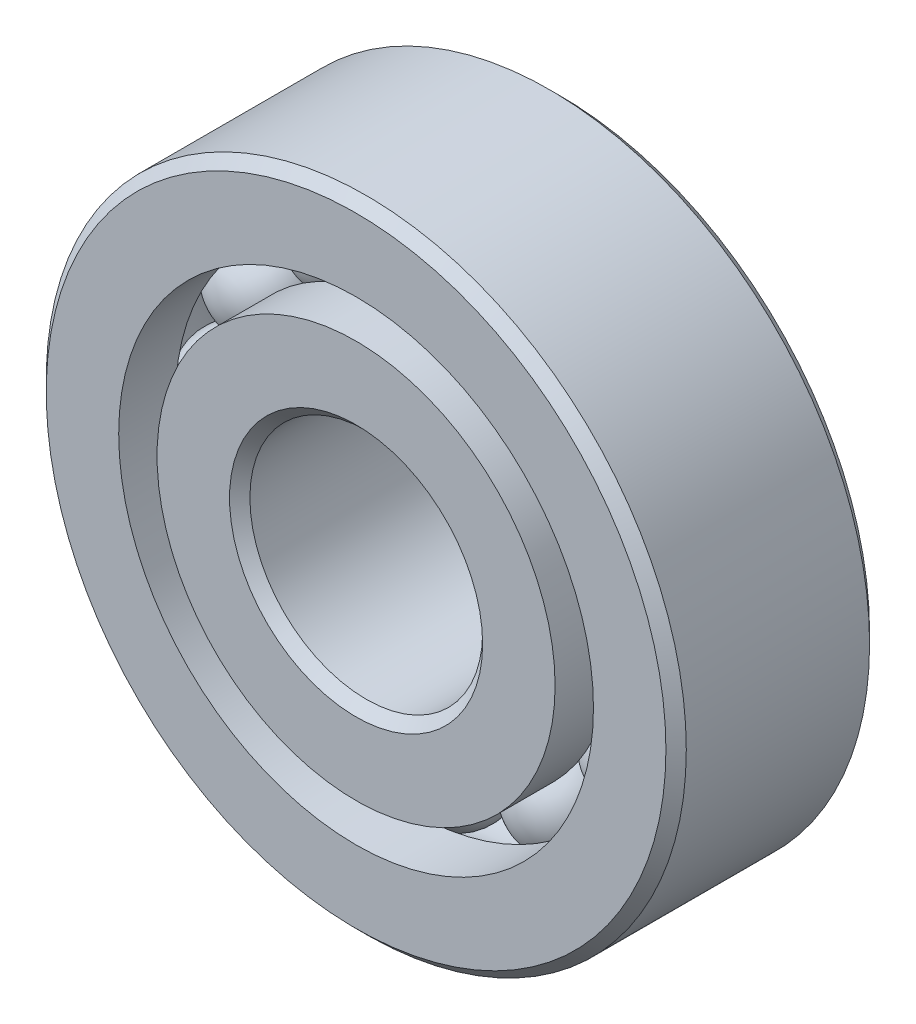
ISO-10303-21;
HEADER;
FILE_DESCRIPTION(('STEP AP214'),'2;1');
FILE_NAME('part.step','',(''),(''),'','','');
FILE_SCHEMA(('AUTOMOTIVE_DESIGN { 1 0 10303 214 1 1 1 1 }'));
ENDSEC;
DATA;
#1=APPLICATION_CONTEXT('core data for automotive mechanical design processes');
#2=APPLICATION_PROTOCOL_DEFINITION('international standard','automotive_design',2000,#1);
#3=PRODUCT_CONTEXT('',#1,'mechanical');
#4=PRODUCT('Part','Part','',(#3));
#5=PRODUCT_RELATED_PRODUCT_CATEGORY('part','',(#4));
#6=PRODUCT_DEFINITION_FORMATION('','',#4);
#7=PRODUCT_DEFINITION_CONTEXT('part definition',#1,'design');
#8=PRODUCT_DEFINITION('design','',#6,#7);
#9=PRODUCT_DEFINITION_SHAPE('','',#8);
#10=(LENGTH_UNIT() NAMED_UNIT(*) SI_UNIT(.MILLI.,.METRE.));
#11=(NAMED_UNIT(*) PLANE_ANGLE_UNIT() SI_UNIT($,.RADIAN.));
#12=(NAMED_UNIT(*) SI_UNIT($,.STERADIAN.) SOLID_ANGLE_UNIT());
#13=UNCERTAINTY_MEASURE_WITH_UNIT(LENGTH_MEASURE(1.E-05),#10,'distance_accuracy_value','');
#14=(GEOMETRIC_REPRESENTATION_CONTEXT(3) GLOBAL_UNCERTAINTY_ASSIGNED_CONTEXT((#13)) GLOBAL_UNIT_ASSIGNED_CONTEXT((#10,
#11,#12)) REPRESENTATION_CONTEXT('',''));
#15=CARTESIAN_POINT('',(0.,0.,0.));
#16=DIRECTION('',(0.,0.,1.));
#17=DIRECTION('',(1.,0.,0.));
#18=AXIS2_PLACEMENT_3D('',#15,#16,#17);
#19=CARTESIAN_POINT('',(-3.74999999999992,6.49519052838334,0.));
#20=DIRECTION('',(0.,0.,1.));
#21=DIRECTION('',(-0.499999999999989,0.866025403784445,0.));
#22=AXIS2_PLACEMENT_3D('',#19,#20,#21);
#23=SPHERICAL_SURFACE('',#22,1.68952158656808);
#24=CARTESIAN_POINT('',(-3.74999999999992,6.49519052838334,1.68952158656808));
#25=VERTEX_POINT('',#24);
#26=VERTEX_LOOP('',#25);
#27=FACE_BOUND('',#26,.T.);
#28=ADVANCED_FACE('F43',(#27),#23,.T.);
#29=CLOSED_SHELL('',(#28));
#30=MANIFOLD_SOLID_BREP('B2',#29);
#31=CARTESIAN_POINT('',(-6.49519052838325,3.75000000000008,0.));
#32=DIRECTION('',(0.,0.,1.));
#33=DIRECTION('',(-0.866025403784433,0.50000000000001,0.));
#34=AXIS2_PLACEMENT_3D('',#31,#32,#33);
#35=SPHERICAL_SURFACE('',#34,1.68952158656808);
#36=CARTESIAN_POINT('',(-6.49519052838325,3.75000000000008,1.68952158656808));
#37=VERTEX_POINT('',#36);
#38=VERTEX_LOOP('',#37);
#39=FACE_BOUND('',#38,.T.);
#40=ADVANCED_FACE('F64',(#39),#35,.T.);
#41=CLOSED_SHELL('',(#40));
#42=MANIFOLD_SOLID_BREP('B6',#41);
#43=CARTESIAN_POINT('',(-7.5,0.,0.));
#44=DIRECTION('',(0.,0.,1.));
#45=DIRECTION('',(-1.,0.,0.));
#46=AXIS2_PLACEMENT_3D('',#43,#44,#45);
#47=SPHERICAL_SURFACE('',#46,1.68952158656808);
#48=CARTESIAN_POINT('',(-7.5,0.,1.68952158656808));
#49=VERTEX_POINT('',#48);
#50=VERTEX_LOOP('',#49);
#51=FACE_BOUND('',#50,.T.);
#52=ADVANCED_FACE('F88',(#51),#47,.T.);
#53=CLOSED_SHELL('',(#52));
#54=MANIFOLD_SOLID_BREP('B39',#53);
#55=CARTESIAN_POINT('',(-6.49519052838332,-3.74999999999994,0.));
#56=DIRECTION('',(0.,0.,1.));
#57=DIRECTION('',(-0.866025403784443,-0.499999999999992,0.));
#58=AXIS2_PLACEMENT_3D('',#55,#56,#57);
#59=SPHERICAL_SURFACE('',#58,1.68952158656808);
#60=CARTESIAN_POINT('',(-6.49519052838332,-3.74999999999994,1.68952158656808));
#61=VERTEX_POINT('',#60);
#62=VERTEX_LOOP('',#61);
#63=FACE_BOUND('',#62,.T.);
#64=ADVANCED_FACE('F111',(#63),#59,.T.);
#65=CLOSED_SHELL('',(#64));
#66=MANIFOLD_SOLID_BREP('B60',#65);
#67=CARTESIAN_POINT('',(-3.75000000000005,-6.49519052838326,0.));
#68=DIRECTION('',(0.,0.,1.));
#69=DIRECTION('',(-0.500000000000007,-0.866025403784435,0.));
#70=AXIS2_PLACEMENT_3D('',#67,#68,#69);
#71=SPHERICAL_SURFACE('',#70,1.68952158656808);
#72=CARTESIAN_POINT('',(-3.75000000000005,-6.49519052838326,1.68952158656808));
#73=VERTEX_POINT('',#72);
#74=VERTEX_LOOP('',#73);
#75=FACE_BOUND('',#74,.T.);
#76=ADVANCED_FACE('F131',(#75),#71,.T.);
#77=CLOSED_SHELL('',(#76));
#78=MANIFOLD_SOLID_BREP('B84',#77);
#79=CARTESIAN_POINT('',(0.,-7.5,0.));
#80=DIRECTION('',(0.,0.,1.));
#81=DIRECTION('',(0.,-1.,0.));
#82=AXIS2_PLACEMENT_3D('',#79,#80,#81);
#83=SPHERICAL_SURFACE('',#82,1.68952158656808);
#84=CARTESIAN_POINT('',(0.,-7.5,1.68952158656808));
#85=VERTEX_POINT('',#84);
#86=VERTEX_LOOP('',#85);
#87=FACE_BOUND('',#86,.T.);
#88=ADVANCED_FACE('F151',(#87),#83,.T.);
#89=CLOSED_SHELL('',(#88));
#90=MANIFOLD_SOLID_BREP('B107',#89);
#91=CARTESIAN_POINT('',(3.74999999999996,-6.49519052838331,0.));
#92=DIRECTION('',(0.,0.,1.));
#93=DIRECTION('',(0.499999999999995,-0.866025403784442,0.));
#94=AXIS2_PLACEMENT_3D('',#91,#92,#93);
#95=SPHERICAL_SURFACE('',#94,1.68952158656808);
#96=CARTESIAN_POINT('',(3.74999999999996,-6.49519052838331,1.68952158656808));
#97=VERTEX_POINT('',#96);
#98=VERTEX_LOOP('',#97);
#99=FACE_BOUND('',#98,.T.);
#100=ADVANCED_FACE('F172',(#99),#95,.T.);
#101=CLOSED_SHELL('',(#100));
#102=MANIFOLD_SOLID_BREP('B127',#101);
#103=CARTESIAN_POINT('',(6.49519052838327,-3.75000000000003,0.));
#104=DIRECTION('',(0.,0.,1.));
#105=DIRECTION('',(0.866025403784436,-0.500000000000004,0.));
#106=AXIS2_PLACEMENT_3D('',#103,#104,#105);
#107=SPHERICAL_SURFACE('',#106,1.68952158656808);
#108=CARTESIAN_POINT('',(6.49519052838327,-3.75000000000003,1.68952158656808));
#109=VERTEX_POINT('',#108);
#110=VERTEX_LOOP('',#109);
#111=FACE_BOUND('',#110,.T.);
#112=ADVANCED_FACE('F196',(#111),#107,.T.);
#113=CLOSED_SHELL('',(#112));
#114=MANIFOLD_SOLID_BREP('B147',#113);
#115=CARTESIAN_POINT('',(7.5,0.,0.));
#116=DIRECTION('',(0.,0.,1.));
#117=DIRECTION('',(1.,0.,0.));
#118=AXIS2_PLACEMENT_3D('',#115,#116,#117);
#119=SPHERICAL_SURFACE('',#118,1.68952158656808);
#120=CARTESIAN_POINT('',(7.5,0.,1.68952158656808));
#121=VERTEX_POINT('',#120);
#122=VERTEX_LOOP('',#121);
#123=FACE_BOUND('',#122,.T.);
#124=ADVANCED_FACE('F220',(#123),#119,.T.);
#125=CLOSED_SHELL('',(#124));
#126=MANIFOLD_SOLID_BREP('B168',#125);
#127=CARTESIAN_POINT('',(6.4951905283833,3.74999999999998,0.));
#128=DIRECTION('',(0.,0.,1.));
#129=DIRECTION('',(0.86602540378444,0.499999999999998,0.));
#130=AXIS2_PLACEMENT_3D('',#127,#128,#129);
#131=SPHERICAL_SURFACE('',#130,1.68952158656808);
#132=CARTESIAN_POINT('',(6.4951905283833,3.74999999999998,1.68952158656808));
#133=VERTEX_POINT('',#132);
#134=VERTEX_LOOP('',#133);
#135=FACE_BOUND('',#134,.T.);
#136=ADVANCED_FACE('F244',(#135),#131,.T.);
#137=CLOSED_SHELL('',(#136));
#138=MANIFOLD_SOLID_BREP('B192',#137);
#139=CARTESIAN_POINT('',(3.75000000000001,6.49519052838328,0.));
#140=DIRECTION('',(0.,0.,1.));
#141=DIRECTION('',(0.500000000000001,0.866025403784438,0.));
#142=AXIS2_PLACEMENT_3D('',#139,#140,#141);
#143=SPHERICAL_SURFACE('',#142,1.68952158656808);
#144=CARTESIAN_POINT('',(3.75000000000001,6.49519052838328,1.68952158656808));
#145=VERTEX_POINT('',#144);
#146=VERTEX_LOOP('',#145);
#147=FACE_BOUND('',#146,.T.);
#148=ADVANCED_FACE('F268',(#147),#143,.T.);
#149=CLOSED_SHELL('',(#148));
#150=MANIFOLD_SOLID_BREP('B216',#149);
#151=CARTESIAN_POINT('',(0.,7.5,0.));
#152=DIRECTION('',(0.,0.,1.));
#153=DIRECTION('',(0.,1.,0.));
#154=AXIS2_PLACEMENT_3D('',#151,#152,#153);
#155=SPHERICAL_SURFACE('',#154,1.68952158656808);
#156=CARTESIAN_POINT('',(0.,7.5,1.68952158656808));
#157=VERTEX_POINT('',#156);
#158=VERTEX_LOOP('',#157);
#159=FACE_BOUND('',#158,.T.);
#160=ADVANCED_FACE('F294',(#159),#155,.T.);
#161=CLOSED_SHELL('',(#160));
#162=MANIFOLD_SOLID_BREP('B240',#161);
#163=CARTESIAN_POINT('',(0.,6.84065934065934,3.5));
#164=DIRECTION('',(0.,0.,-1.));
#165=DIRECTION('',(-1.,0.,0.));
#166=AXIS2_PLACEMENT_3D('',#163,#164,#165);
#167=PLANE('',#166);
#168=CARTESIAN_POINT('',(0.,0.,3.5));
#169=DIRECTION('',(0.,0.,1.));
#170=DIRECTION('',(1.,0.,0.));
#171=AXIS2_PLACEMENT_3D('',#168,#169,#170);
#172=CIRCLE('',#171,4.35);
#173=CARTESIAN_POINT('',(4.35,0.,3.5));
#174=VERTEX_POINT('',#173);
#175=EDGE_CURVE('E345',#174,#174,#172,.T.);
#176=ORIENTED_EDGE('',*,*,#175,.F.);
#177=EDGE_LOOP('',(#176));
#178=FACE_BOUND('',#177,.T.);
#179=CARTESIAN_POINT('',(0.,0.,3.5));
#180=DIRECTION('',(0.,0.,1.));
#181=DIRECTION('',(1.,0.,0.));
#182=AXIS2_PLACEMENT_3D('',#179,#180,#181);
#183=CIRCLE('',#182,6.84065934065934);
#184=CARTESIAN_POINT('',(6.84065934065934,0.,3.5));
#185=VERTEX_POINT('',#184);
#186=EDGE_CURVE('E293',#185,#185,#183,.T.);
#187=ORIENTED_EDGE('',*,*,#186,.T.);
#188=EDGE_LOOP('',(#187));
#189=FACE_BOUND('',#188,.T.);
#190=ADVANCED_FACE('F317',(#178,#189),#167,.F.);
#191=CARTESIAN_POINT('',(0.,0.,3.5));
#192=DIRECTION('',(0.,0.,1.));
#193=DIRECTION('',(1.,0.,0.));
#194=AXIS2_PLACEMENT_3D('',#191,#192,#193);
#195=CYLINDRICAL_SURFACE('',#194,6.84065934065934);
#196=ORIENTED_EDGE('',*,*,#186,.F.);
#197=EDGE_LOOP('',(#196));
#198=FACE_BOUND('',#197,.T.);
#199=CARTESIAN_POINT('',(0.,0.,1.55555555555556));
#200=DIRECTION('',(0.,0.,1.));
#201=DIRECTION('',(1.,0.,0.));
#202=AXIS2_PLACEMENT_3D('',#199,#200,#201);
#203=CIRCLE('',#202,6.84065934065934);
#204=CARTESIAN_POINT('',(6.84065934065934,0.,1.55555555555556));
#205=VERTEX_POINT('',#204);
#206=EDGE_CURVE('E323',#205,#205,#203,.T.);
#207=ORIENTED_EDGE('',*,*,#206,.T.);
#208=EDGE_LOOP('',(#207));
#209=FACE_BOUND('',#208,.T.);
#210=ADVANCED_FACE('F352',(#198,#209),#195,.T.);
#211=CARTESIAN_POINT('',(0.,0.,0.));
#212=DIRECTION('',(0.,0.,1.));
#213=DIRECTION('',(1.,0.,0.));
#214=AXIS2_PLACEMENT_3D('',#211,#212,#213);
#215=TOROIDAL_SURFACE('',#214,7.5,1.68952158656808);
#216=ORIENTED_EDGE('',*,*,#206,.F.);
#217=EDGE_LOOP('',(#216));
#218=FACE_BOUND('',#217,.T.);
#219=CARTESIAN_POINT('',(0.,0.,-1.55555555555556));
#220=DIRECTION('',(0.,0.,1.));
#221=DIRECTION('',(1.,0.,0.));
#222=AXIS2_PLACEMENT_3D('',#219,#220,#221);
#223=CIRCLE('',#222,6.84065934065934);
#224=CARTESIAN_POINT('',(6.84065934065934,0.,-1.55555555555556));
#225=VERTEX_POINT('',#224);
#226=EDGE_CURVE('E327',#225,#225,#223,.T.);
#227=ORIENTED_EDGE('',*,*,#226,.T.);
#228=EDGE_LOOP('',(#227));
#229=FACE_BOUND('',#228,.T.);
#230=ADVANCED_FACE('F356',(#218,#229),#215,.F.);
#231=CARTESIAN_POINT('',(0.,0.,3.5));
#232=DIRECTION('',(0.,0.,1.));
#233=DIRECTION('',(1.,0.,0.));
#234=AXIS2_PLACEMENT_3D('',#231,#232,#233);
#235=CYLINDRICAL_SURFACE('',#234,6.84065934065934);
#236=ORIENTED_EDGE('',*,*,#226,.F.);
#237=EDGE_LOOP('',(#236));
#238=FACE_BOUND('',#237,.T.);
#239=CARTESIAN_POINT('',(0.,0.,-3.5));
#240=DIRECTION('',(0.,0.,1.));
#241=DIRECTION('',(1.,0.,0.));
#242=AXIS2_PLACEMENT_3D('',#239,#240,#241);
#243=CIRCLE('',#242,6.84065934065934);
#244=CARTESIAN_POINT('',(6.84065934065934,0.,-3.5));
#245=VERTEX_POINT('',#244);
#246=EDGE_CURVE('E331',#245,#245,#243,.T.);
#247=ORIENTED_EDGE('',*,*,#246,.T.);
#248=EDGE_LOOP('',(#247));
#249=FACE_BOUND('',#248,.T.);
#250=ADVANCED_FACE('F361',(#238,#249),#235,.T.);
#251=CARTESIAN_POINT('',(0.,4.35,-3.5));
#252=DIRECTION('',(0.,0.,1.));
#253=DIRECTION('',(1.,0.,0.));
#254=AXIS2_PLACEMENT_3D('',#251,#252,#253);
#255=PLANE('',#254);
#256=ORIENTED_EDGE('',*,*,#246,.F.);
#257=EDGE_LOOP('',(#256));
#258=FACE_BOUND('',#257,.T.);
#259=CARTESIAN_POINT('',(0.,0.,-3.5));
#260=DIRECTION('',(0.,0.,1.));
#261=DIRECTION('',(1.,0.,0.));
#262=AXIS2_PLACEMENT_3D('',#259,#260,#261);
#263=CIRCLE('',#262,4.35);
#264=CARTESIAN_POINT('',(4.35,0.,-3.5));
#265=VERTEX_POINT('',#264);
#266=EDGE_CURVE('E336',#265,#265,#263,.T.);
#267=ORIENTED_EDGE('',*,*,#266,.T.);
#268=EDGE_LOOP('',(#267));
#269=FACE_BOUND('',#268,.T.);
#270=ADVANCED_FACE('F367',(#258,#269),#255,.F.);
#271=CARTESIAN_POINT('',(0.,0.,-3.15));
#272=DIRECTION('',(0.,0.,-1.));
#273=DIRECTION('',(-1.,0.,0.));
#274=AXIS2_PLACEMENT_3D('',#271,#272,#273);
#275=CONICAL_SURFACE('',#274,4.,0.78539816339745);
#276=ORIENTED_EDGE('',*,*,#266,.F.);
#277=EDGE_LOOP('',(#276));
#278=FACE_BOUND('',#277,.T.);
#279=CARTESIAN_POINT('',(0.,0.,-3.15));
#280=DIRECTION('',(0.,0.,1.));
#281=DIRECTION('',(1.,0.,0.));
#282=AXIS2_PLACEMENT_3D('',#279,#280,#281);
#283=CIRCLE('',#282,4.);
#284=CARTESIAN_POINT('',(4.,0.,-3.15));
#285=VERTEX_POINT('',#284);
#286=EDGE_CURVE('E339',#285,#285,#283,.T.);
#287=ORIENTED_EDGE('',*,*,#286,.T.);
#288=EDGE_LOOP('',(#287));
#289=FACE_BOUND('',#288,.T.);
#290=ADVANCED_FACE('F371',(#278,#289),#275,.F.);
#291=CARTESIAN_POINT('',(0.,0.,3.5));
#292=DIRECTION('',(0.,0.,1.));
#293=DIRECTION('',(1.,0.,0.));
#294=AXIS2_PLACEMENT_3D('',#291,#292,#293);
#295=CYLINDRICAL_SURFACE('',#294,4.);
#296=ORIENTED_EDGE('',*,*,#286,.F.);
#297=EDGE_LOOP('',(#296));
#298=FACE_BOUND('',#297,.T.);
#299=CARTESIAN_POINT('',(0.,0.,3.15));
#300=DIRECTION('',(0.,0.,1.));
#301=DIRECTION('',(1.,0.,0.));
#302=AXIS2_PLACEMENT_3D('',#299,#300,#301);
#303=CIRCLE('',#302,4.);
#304=CARTESIAN_POINT('',(4.,0.,3.15));
#305=VERTEX_POINT('',#304);
#306=EDGE_CURVE('E342',#305,#305,#303,.T.);
#307=ORIENTED_EDGE('',*,*,#306,.T.);
#308=EDGE_LOOP('',(#307));
#309=FACE_BOUND('',#308,.T.);
#310=ADVANCED_FACE('F375',(#298,#309),#295,.F.);
#311=CARTESIAN_POINT('',(0.,0.,3.5));
#312=DIRECTION('',(0.,0.,1.));
#313=DIRECTION('',(1.,0.,0.));
#314=AXIS2_PLACEMENT_3D('',#311,#312,#313);
#315=CONICAL_SURFACE('',#314,4.35,0.78539816339745);
#316=ORIENTED_EDGE('',*,*,#306,.F.);
#317=EDGE_LOOP('',(#316));
#318=FACE_BOUND('',#317,.T.);
#319=ORIENTED_EDGE('',*,*,#175,.T.);
#320=EDGE_LOOP('',(#319));
#321=FACE_BOUND('',#320,.T.);
#322=ADVANCED_FACE('F349',(#318,#321),#315,.F.);
#323=CLOSED_SHELL('',(#190,#210,#230,#250,#270,#290,#310,#322));
#324=MANIFOLD_SOLID_BREP('B264',#323);
#325=CARTESIAN_POINT('',(0.,0.,3.15));
#326=DIRECTION('',(0.,0.,-1.));
#327=DIRECTION('',(-1.,0.,0.));
#328=AXIS2_PLACEMENT_3D('',#325,#326,#327);
#329=CONICAL_SURFACE('',#328,11.,0.785398163397448);
#330=CARTESIAN_POINT('',(0.,0.,3.5));
#331=DIRECTION('',(0.,0.,1.));
#332=DIRECTION('',(1.,0.,0.));
#333=AXIS2_PLACEMENT_3D('',#330,#331,#332);
#334=CIRCLE('',#333,10.65);
#335=CARTESIAN_POINT('',(10.65,0.,3.5));
#336=VERTEX_POINT('',#335);
#337=EDGE_CURVE('E469',#336,#336,#334,.T.);
#338=ORIENTED_EDGE('',*,*,#337,.F.);
#339=EDGE_LOOP('',(#338));
#340=FACE_BOUND('',#339,.T.);
#341=CARTESIAN_POINT('',(0.,0.,3.15));
#342=DIRECTION('',(0.,0.,1.));
#343=DIRECTION('',(1.,0.,0.));
#344=AXIS2_PLACEMENT_3D('',#341,#342,#343);
#345=CIRCLE('',#344,11.);
#346=CARTESIAN_POINT('',(11.,0.,3.15));
#347=VERTEX_POINT('',#346);
#348=EDGE_CURVE('E316',#347,#347,#345,.T.);
#349=ORIENTED_EDGE('',*,*,#348,.T.);
#350=EDGE_LOOP('',(#349));
#351=FACE_BOUND('',#350,.T.);
#352=ADVANCED_FACE('F441',(#340,#351),#329,.T.);
#353=CARTESIAN_POINT('',(0.,0.,3.5));
#354=DIRECTION('',(0.,0.,1.));
#355=DIRECTION('',(1.,0.,0.));
#356=AXIS2_PLACEMENT_3D('',#353,#354,#355);
#357=CYLINDRICAL_SURFACE('',#356,11.);
#358=ORIENTED_EDGE('',*,*,#348,.F.);
#359=EDGE_LOOP('',(#358));
#360=FACE_BOUND('',#359,.T.);
#361=CARTESIAN_POINT('',(0.,0.,-3.15));
#362=DIRECTION('',(0.,0.,1.));
#363=DIRECTION('',(1.,0.,0.));
#364=AXIS2_PLACEMENT_3D('',#361,#362,#363);
#365=CIRCLE('',#364,11.);
#366=CARTESIAN_POINT('',(11.,0.,-3.15));
#367=VERTEX_POINT('',#366);
#368=EDGE_CURVE('E447',#367,#367,#365,.T.);
#369=ORIENTED_EDGE('',*,*,#368,.T.);
#370=EDGE_LOOP('',(#369));
#371=FACE_BOUND('',#370,.T.);
#372=ADVANCED_FACE('F476',(#360,#371),#357,.T.);
#373=CARTESIAN_POINT('',(0.,0.,-3.5));
#374=DIRECTION('',(0.,0.,1.));
#375=DIRECTION('',(1.,0.,0.));
#376=AXIS2_PLACEMENT_3D('',#373,#374,#375);
#377=CONICAL_SURFACE('',#376,10.65,0.785398163397448);
#378=ORIENTED_EDGE('',*,*,#368,.F.);
#379=EDGE_LOOP('',(#378));
#380=FACE_BOUND('',#379,.T.);
#381=CARTESIAN_POINT('',(0.,0.,-3.5));
#382=DIRECTION('',(0.,0.,1.));
#383=DIRECTION('',(1.,0.,0.));
#384=AXIS2_PLACEMENT_3D('',#381,#382,#383);
#385=CIRCLE('',#384,10.65);
#386=CARTESIAN_POINT('',(10.65,0.,-3.5));
#387=VERTEX_POINT('',#386);
#388=EDGE_CURVE('E451',#387,#387,#385,.T.);
#389=ORIENTED_EDGE('',*,*,#388,.T.);
#390=EDGE_LOOP('',(#389));
#391=FACE_BOUND('',#390,.T.);
#392=ADVANCED_FACE('F480',(#380,#391),#377,.T.);
#393=CARTESIAN_POINT('',(0.,10.65,-3.5));
#394=DIRECTION('',(0.,0.,1.));
#395=DIRECTION('',(1.,0.,0.));
#396=AXIS2_PLACEMENT_3D('',#393,#394,#395);
#397=PLANE('',#396);
#398=ORIENTED_EDGE('',*,*,#388,.F.);
#399=EDGE_LOOP('',(#398));
#400=FACE_BOUND('',#399,.T.);
#401=CARTESIAN_POINT('',(0.,0.,-3.5));
#402=DIRECTION('',(0.,0.,1.));
#403=DIRECTION('',(1.,0.,0.));
#404=AXIS2_PLACEMENT_3D('',#401,#402,#403);
#405=CIRCLE('',#404,8.15934065934066);
#406=CARTESIAN_POINT('',(8.15934065934066,0.,-3.5));
#407=VERTEX_POINT('',#406);
#408=EDGE_CURVE('E455',#407,#407,#405,.T.);
#409=ORIENTED_EDGE('',*,*,#408,.T.);
#410=EDGE_LOOP('',(#409));
#411=FACE_BOUND('',#410,.T.);
#412=ADVANCED_FACE('F485',(#400,#411),#397,.F.);
#413=CARTESIAN_POINT('',(0.,0.,3.5));
#414=DIRECTION('',(0.,0.,1.));
#415=DIRECTION('',(1.,0.,0.));
#416=AXIS2_PLACEMENT_3D('',#413,#414,#415);
#417=CYLINDRICAL_SURFACE('',#416,8.15934065934066);
#418=ORIENTED_EDGE('',*,*,#408,.F.);
#419=EDGE_LOOP('',(#418));
#420=FACE_BOUND('',#419,.T.);
#421=CARTESIAN_POINT('',(0.,0.,-1.55555555555556));
#422=DIRECTION('',(0.,0.,1.));
#423=DIRECTION('',(1.,0.,0.));
#424=AXIS2_PLACEMENT_3D('',#421,#422,#423);
#425=CIRCLE('',#424,8.15934065934066);
#426=CARTESIAN_POINT('',(8.15934065934066,0.,-1.55555555555556));
#427=VERTEX_POINT('',#426);
#428=EDGE_CURVE('E460',#427,#427,#425,.T.);
#429=ORIENTED_EDGE('',*,*,#428,.T.);
#430=EDGE_LOOP('',(#429));
#431=FACE_BOUND('',#430,.T.);
#432=ADVANCED_FACE('F491',(#420,#431),#417,.F.);
#433=CARTESIAN_POINT('',(0.,0.,0.));
#434=DIRECTION('',(0.,0.,1.));
#435=DIRECTION('',(1.,0.,0.));
#436=AXIS2_PLACEMENT_3D('',#433,#434,#435);
#437=TOROIDAL_SURFACE('',#436,7.5,1.68952158656808);
#438=ORIENTED_EDGE('',*,*,#428,.F.);
#439=EDGE_LOOP('',(#438));
#440=FACE_BOUND('',#439,.T.);
#441=CARTESIAN_POINT('',(0.,0.,1.55555555555556));
#442=DIRECTION('',(0.,0.,1.));
#443=DIRECTION('',(1.,0.,0.));
#444=AXIS2_PLACEMENT_3D('',#441,#442,#443);
#445=CIRCLE('',#444,8.15934065934066);
#446=CARTESIAN_POINT('',(8.15934065934066,0.,1.55555555555556));
#447=VERTEX_POINT('',#446);
#448=EDGE_CURVE('E463',#447,#447,#445,.T.);
#449=ORIENTED_EDGE('',*,*,#448,.T.);
#450=EDGE_LOOP('',(#449));
#451=FACE_BOUND('',#450,.T.);
#452=ADVANCED_FACE('F495',(#440,#451),#437,.F.);
#453=CARTESIAN_POINT('',(0.,0.,3.5));
#454=DIRECTION('',(0.,0.,1.));
#455=DIRECTION('',(1.,0.,0.));
#456=AXIS2_PLACEMENT_3D('',#453,#454,#455);
#457=CYLINDRICAL_SURFACE('',#456,8.15934065934066);
#458=ORIENTED_EDGE('',*,*,#448,.F.);
#459=EDGE_LOOP('',(#458));
#460=FACE_BOUND('',#459,.T.);
#461=CARTESIAN_POINT('',(0.,0.,3.5));
#462=DIRECTION('',(0.,0.,1.));
#463=DIRECTION('',(1.,0.,0.));
#464=AXIS2_PLACEMENT_3D('',#461,#462,#463);
#465=CIRCLE('',#464,8.15934065934066);
#466=CARTESIAN_POINT('',(8.15934065934066,0.,3.5));
#467=VERTEX_POINT('',#466);
#468=EDGE_CURVE('E466',#467,#467,#465,.T.);
#469=ORIENTED_EDGE('',*,*,#468,.T.);
#470=EDGE_LOOP('',(#469));
#471=FACE_BOUND('',#470,.T.);
#472=ADVANCED_FACE('F499',(#460,#471),#457,.F.);
#473=CARTESIAN_POINT('',(0.,10.65,3.5));
#474=DIRECTION('',(0.,0.,-1.));
#475=DIRECTION('',(-1.,0.,0.));
#476=AXIS2_PLACEMENT_3D('',#473,#474,#475);
#477=PLANE('',#476);
#478=ORIENTED_EDGE('',*,*,#468,.F.);
#479=EDGE_LOOP('',(#478));
#480=FACE_BOUND('',#479,.T.);
#481=ORIENTED_EDGE('',*,*,#337,.T.);
#482=EDGE_LOOP('',(#481));
#483=FACE_BOUND('',#482,.T.);
#484=ADVANCED_FACE('F473',(#480,#483),#477,.F.);
#485=CLOSED_SHELL('',(#352,#372,#392,#412,#432,#452,#472,#484));
#486=MANIFOLD_SOLID_BREP('B288',#485);
#487=ADVANCED_BREP_SHAPE_REPRESENTATION('',(#18,#30,#42,#54,#66,#78,#90,#102,#114,#126,#138,
#150,#162,#324,#486),#14);
#488=SHAPE_DEFINITION_REPRESENTATION(#9,#487);
ENDSEC;
END-ISO-10303-21;
